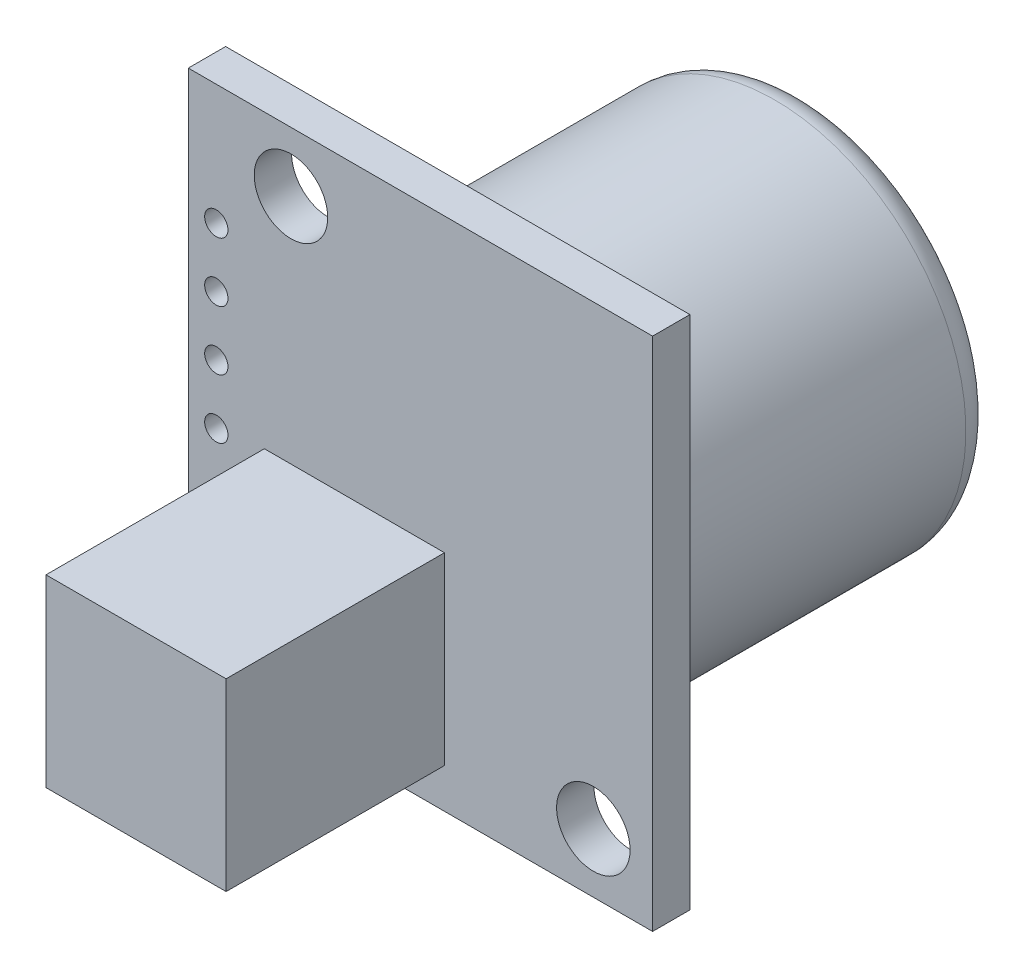
ISO-10303-21;
HEADER;
FILE_DESCRIPTION(('STEP AP214'),'2;1');
FILE_NAME('part.step','',(''),(''),'','','');
FILE_SCHEMA(('AUTOMOTIVE_DESIGN { 1 0 10303 214 1 1 1 1 }'));
ENDSEC;
DATA;
#1=APPLICATION_CONTEXT('core data for automotive mechanical design processes');
#2=APPLICATION_PROTOCOL_DEFINITION('international standard','automotive_design',2000,#1);
#3=PRODUCT_CONTEXT('',#1,'mechanical');
#4=PRODUCT('Part','Part','',(#3));
#5=PRODUCT_RELATED_PRODUCT_CATEGORY('part','',(#4));
#6=PRODUCT_DEFINITION_FORMATION('','',#4);
#7=PRODUCT_DEFINITION_CONTEXT('part definition',#1,'design');
#8=PRODUCT_DEFINITION('design','',#6,#7);
#9=PRODUCT_DEFINITION_SHAPE('','',#8);
#10=(LENGTH_UNIT() NAMED_UNIT(*) SI_UNIT(.MILLI.,.METRE.));
#11=(NAMED_UNIT(*) PLANE_ANGLE_UNIT() SI_UNIT($,.RADIAN.));
#12=(NAMED_UNIT(*) SI_UNIT($,.STERADIAN.) SOLID_ANGLE_UNIT());
#13=UNCERTAINTY_MEASURE_WITH_UNIT(LENGTH_MEASURE(1.E-05),#10,'distance_accuracy_value','');
#14=(GEOMETRIC_REPRESENTATION_CONTEXT(3) GLOBAL_UNCERTAINTY_ASSIGNED_CONTEXT((#13)) GLOBAL_UNIT_ASSIGNED_CONTEXT((#10,
#11,#12)) REPRESENTATION_CONTEXT('',''));
#15=CARTESIAN_POINT('',(0.,0.,0.));
#16=DIRECTION('',(0.,0.,1.));
#17=DIRECTION('',(1.,0.,0.));
#18=AXIS2_PLACEMENT_3D('',#15,#16,#17);
#19=CARTESIAN_POINT('',(0.,0.,1.6));
#20=DIRECTION('',(0.,0.,-1.));
#21=DIRECTION('',(-1.,0.,0.));
#22=AXIS2_PLACEMENT_3D('',#19,#20,#21);
#23=PLANE('',#22);
#24=CARTESIAN_POINT('',(-8.75000000000006,5.88999999999999,1.6));
#25=DIRECTION('',(0.,0.,1.));
#26=DIRECTION('',(1.,0.,0.));
#27=AXIS2_PLACEMENT_3D('',#24,#25,#26);
#28=CIRCLE('',#27,0.500000000000001);
#29=CARTESIAN_POINT('',(-8.25000000000006,5.88999999999999,1.6));
#30=VERTEX_POINT('',#29);
#31=EDGE_CURVE('E130',#30,#30,#28,.T.);
#32=ORIENTED_EDGE('',*,*,#31,.F.);
#33=EDGE_LOOP('',(#32));
#34=FACE_BOUND('',#33,.T.);
#35=CARTESIAN_POINT('',(-8.75000000000004,0.809999999999993,1.6));
#36=DIRECTION('',(0.,0.,1.));
#37=DIRECTION('',(1.,0.,0.));
#38=AXIS2_PLACEMENT_3D('',#35,#36,#37);
#39=CIRCLE('',#38,0.500000000000001);
#40=CARTESIAN_POINT('',(-8.25000000000004,0.809999999999993,1.6));
#41=VERTEX_POINT('',#40);
#42=EDGE_CURVE('E142',#41,#41,#39,.T.);
#43=ORIENTED_EDGE('',*,*,#42,.F.);
#44=EDGE_LOOP('',(#43));
#45=FACE_BOUND('',#44,.T.);
#46=CARTESIAN_POINT('',(-8.75000000000002,-4.27000000000001,1.6));
#47=DIRECTION('',(0.,0.,1.));
#48=DIRECTION('',(1.,0.,0.));
#49=AXIS2_PLACEMENT_3D('',#46,#47,#48);
#50=CIRCLE('',#49,0.500000000000001);
#51=CARTESIAN_POINT('',(-8.25000000000002,-4.27000000000001,1.6));
#52=VERTEX_POINT('',#51);
#53=EDGE_CURVE('E154',#52,#52,#50,.T.);
#54=ORIENTED_EDGE('',*,*,#53,.F.);
#55=EDGE_LOOP('',(#54));
#56=FACE_BOUND('',#55,.T.);
#57=CARTESIAN_POINT('',(-8.75000000000001,-9.35000000000001,1.6));
#58=DIRECTION('',(0.,0.,1.));
#59=DIRECTION('',(1.,0.,0.));
#60=AXIS2_PLACEMENT_3D('',#57,#58,#59);
#61=CIRCLE('',#60,0.500000000000001);
#62=CARTESIAN_POINT('',(-8.25000000000001,-9.35000000000001,1.6));
#63=VERTEX_POINT('',#62);
#64=EDGE_CURVE('E166',#63,#63,#61,.T.);
#65=ORIENTED_EDGE('',*,*,#64,.F.);
#66=EDGE_LOOP('',(#65));
#67=FACE_BOUND('',#66,.T.);
#68=CARTESIAN_POINT('',(-5.55000000000001,8.48999999999999,1.6));
#69=DIRECTION('',(0.,0.,1.));
#70=DIRECTION('',(1.,0.,0.));
#71=AXIS2_PLACEMENT_3D('',#68,#69,#70);
#72=CIRCLE('',#71,1.5748);
#73=CARTESIAN_POINT('',(-3.97520000000001,8.48999999999999,1.6));
#74=VERTEX_POINT('',#73);
#75=EDGE_CURVE('E178',#74,#74,#72,.T.);
#76=ORIENTED_EDGE('',*,*,#75,.F.);
#77=EDGE_LOOP('',(#76));
#78=FACE_BOUND('',#77,.T.);
#79=DIRECTION('',(0.,1.,0.));
#80=VECTOR('',#79,1.);
#81=CARTESIAN_POINT('',(9.94999999999999,-11.05,1.6));
#82=LINE('',#81,#80);
#83=CARTESIAN_POINT('',(9.94999999999999,-11.05,1.6));
#84=VERTEX_POINT('',#83);
#85=CARTESIAN_POINT('',(9.94999999999999,11.05,1.6));
#86=VERTEX_POINT('',#85);
#87=EDGE_CURVE('E184',#84,#86,#82,.T.);
#88=ORIENTED_EDGE('',*,*,#87,.T.);
#89=DIRECTION('',(-1.,0.,0.));
#90=VECTOR('',#89,1.);
#91=CARTESIAN_POINT('',(-9.95000000000001,11.05,1.6));
#92=LINE('',#91,#90);
#93=CARTESIAN_POINT('',(-9.95000000000001,11.05,1.6));
#94=VERTEX_POINT('',#93);
#95=EDGE_CURVE('E187',#86,#94,#92,.T.);
#96=ORIENTED_EDGE('',*,*,#95,.T.);
#97=DIRECTION('',(0.,-1.,0.));
#98=VECTOR('',#97,1.);
#99=CARTESIAN_POINT('',(-9.95000000000001,-11.05,1.6));
#100=LINE('',#99,#98);
#101=CARTESIAN_POINT('',(-9.95000000000001,-11.05,1.6));
#102=VERTEX_POINT('',#101);
#103=EDGE_CURVE('E190',#94,#102,#100,.T.);
#104=ORIENTED_EDGE('',*,*,#103,.T.);
#105=DIRECTION('',(1.,0.,0.));
#106=VECTOR('',#105,1.);
#107=CARTESIAN_POINT('',(-9.95000000000001,-11.05,1.6));
#108=LINE('',#107,#106);
#109=EDGE_CURVE('E192',#102,#84,#108,.T.);
#110=ORIENTED_EDGE('',*,*,#109,.T.);
#111=EDGE_LOOP('',(#88,#96,#104,#110));
#112=FACE_BOUND('',#111,.T.);
#113=CARTESIAN_POINT('',(7.40999999999999,-8.51000000000001,1.6));
#114=DIRECTION('',(0.,0.,1.));
#115=DIRECTION('',(1.,0.,0.));
#116=AXIS2_PLACEMENT_3D('',#113,#114,#115);
#117=CIRCLE('',#116,1.5748);
#118=CARTESIAN_POINT('',(8.98479999999999,-8.51000000000001,1.6));
#119=VERTEX_POINT('',#118);
#120=EDGE_CURVE('E172',#119,#119,#117,.T.);
#121=ORIENTED_EDGE('',*,*,#120,.F.);
#122=EDGE_LOOP('',(#121));
#123=FACE_BOUND('',#122,.T.);
#124=CARTESIAN_POINT('',(-8.75000000000002,-6.81000000000001,1.6));
#125=DIRECTION('',(0.,0.,1.));
#126=DIRECTION('',(1.,0.,0.));
#127=AXIS2_PLACEMENT_3D('',#124,#125,#126);
#128=CIRCLE('',#127,0.500000000000001);
#129=CARTESIAN_POINT('',(-8.25000000000002,-6.81000000000001,1.6));
#130=VERTEX_POINT('',#129);
#131=EDGE_CURVE('E160',#130,#130,#128,.T.);
#132=ORIENTED_EDGE('',*,*,#131,.F.);
#133=EDGE_LOOP('',(#132));
#134=FACE_BOUND('',#133,.T.);
#135=CARTESIAN_POINT('',(-8.75000000000003,-1.73000000000001,1.6));
#136=DIRECTION('',(0.,0.,1.));
#137=DIRECTION('',(1.,0.,0.));
#138=AXIS2_PLACEMENT_3D('',#135,#136,#137);
#139=CIRCLE('',#138,0.500000000000001);
#140=CARTESIAN_POINT('',(-8.25000000000003,-1.73000000000001,1.6));
#141=VERTEX_POINT('',#140);
#142=EDGE_CURVE('E148',#141,#141,#139,.T.);
#143=ORIENTED_EDGE('',*,*,#142,.F.);
#144=EDGE_LOOP('',(#143));
#145=FACE_BOUND('',#144,.T.);
#146=CARTESIAN_POINT('',(-8.75000000000005,3.34999999999999,1.6));
#147=DIRECTION('',(0.,0.,1.));
#148=DIRECTION('',(1.,0.,0.));
#149=AXIS2_PLACEMENT_3D('',#146,#147,#148);
#150=CIRCLE('',#149,0.500000000000001);
#151=CARTESIAN_POINT('',(-8.25000000000005,3.34999999999999,1.6));
#152=VERTEX_POINT('',#151);
#153=EDGE_CURVE('E136',#152,#152,#150,.T.);
#154=ORIENTED_EDGE('',*,*,#153,.F.);
#155=EDGE_LOOP('',(#154));
#156=FACE_BOUND('',#155,.T.);
#157=DIRECTION('',(0.,-1.,0.));
#158=VECTOR('',#157,1.);
#159=CARTESIAN_POINT('',(-6.69,-9.35000000000001,1.6));
#160=LINE('',#159,#158);
#161=CARTESIAN_POINT('',(-6.69,-1.45000000000001,1.6));
#162=VERTEX_POINT('',#161);
#163=CARTESIAN_POINT('',(-6.69,-9.35000000000001,1.6));
#164=VERTEX_POINT('',#163);
#165=EDGE_CURVE('E120',#162,#164,#160,.T.);
#166=ORIENTED_EDGE('',*,*,#165,.F.);
#167=DIRECTION('',(-1.,0.,0.));
#168=VECTOR('',#167,1.);
#169=CARTESIAN_POINT('',(-6.69,-1.45000000000001,1.6));
#170=LINE('',#169,#168);
#171=CARTESIAN_POINT('',(1.02999999999999,-1.45000000000001,1.6));
#172=VERTEX_POINT('',#171);
#173=EDGE_CURVE('E117',#172,#162,#170,.T.);
#174=ORIENTED_EDGE('',*,*,#173,.F.);
#175=DIRECTION('',(0.,1.,0.));
#176=VECTOR('',#175,1.);
#177=CARTESIAN_POINT('',(1.02999999999999,-9.35000000000001,1.6));
#178=LINE('',#177,#176);
#179=CARTESIAN_POINT('',(1.02999999999999,-9.35000000000001,1.6));
#180=VERTEX_POINT('',#179);
#181=EDGE_CURVE('E55',#180,#172,#178,.T.);
#182=ORIENTED_EDGE('',*,*,#181,.F.);
#183=DIRECTION('',(1.,0.,0.));
#184=VECTOR('',#183,1.);
#185=CARTESIAN_POINT('',(-6.69,-9.35000000000001,1.6));
#186=LINE('',#185,#184);
#187=EDGE_CURVE('E50',#164,#180,#186,.T.);
#188=ORIENTED_EDGE('',*,*,#187,.F.);
#189=EDGE_LOOP('',(#166,#174,#182,#188));
#190=FACE_BOUND('',#189,.T.);
#191=ADVANCED_FACE('F35',(#34,#45,#56,#67,#78,#112,#123,#134,#145,#156,#190),#23,.F.);
#192=CARTESIAN_POINT('',(0.,0.,0.));
#193=DIRECTION('',(0.,0.,-1.));
#194=DIRECTION('',(-1.,0.,0.));
#195=AXIS2_PLACEMENT_3D('',#192,#193,#194);
#196=PLANE('',#195);
#197=CARTESIAN_POINT('',(-8.75000000000006,5.88999999999999,0.));
#198=DIRECTION('',(0.,0.,1.));
#199=DIRECTION('',(1.,0.,0.));
#200=AXIS2_PLACEMENT_3D('',#197,#198,#199);
#201=CIRCLE('',#200,0.500000000000001);
#202=CARTESIAN_POINT('',(-8.25000000000006,5.88999999999999,0.));
#203=VERTEX_POINT('',#202);
#204=EDGE_CURVE('E124',#203,#203,#201,.T.);
#205=ORIENTED_EDGE('',*,*,#204,.T.);
#206=EDGE_LOOP('',(#205));
#207=FACE_BOUND('',#206,.T.);
#208=CARTESIAN_POINT('',(-8.75000000000004,0.809999999999993,0.));
#209=DIRECTION('',(0.,0.,1.));
#210=DIRECTION('',(1.,0.,0.));
#211=AXIS2_PLACEMENT_3D('',#208,#209,#210);
#212=CIRCLE('',#211,0.500000000000001);
#213=CARTESIAN_POINT('',(-8.25000000000004,0.809999999999993,0.));
#214=VERTEX_POINT('',#213);
#215=EDGE_CURVE('E139',#214,#214,#212,.T.);
#216=ORIENTED_EDGE('',*,*,#215,.T.);
#217=EDGE_LOOP('',(#216));
#218=FACE_BOUND('',#217,.T.);
#219=CARTESIAN_POINT('',(-8.75000000000002,-4.27000000000001,0.));
#220=DIRECTION('',(0.,0.,1.));
#221=DIRECTION('',(1.,0.,0.));
#222=AXIS2_PLACEMENT_3D('',#219,#220,#221);
#223=CIRCLE('',#222,0.500000000000001);
#224=CARTESIAN_POINT('',(-8.25000000000002,-4.27000000000001,0.));
#225=VERTEX_POINT('',#224);
#226=EDGE_CURVE('E151',#225,#225,#223,.T.);
#227=ORIENTED_EDGE('',*,*,#226,.T.);
#228=EDGE_LOOP('',(#227));
#229=FACE_BOUND('',#228,.T.);
#230=CARTESIAN_POINT('',(-8.75000000000001,-9.35000000000001,0.));
#231=DIRECTION('',(0.,0.,1.));
#232=DIRECTION('',(1.,0.,0.));
#233=AXIS2_PLACEMENT_3D('',#230,#231,#232);
#234=CIRCLE('',#233,0.500000000000001);
#235=CARTESIAN_POINT('',(-8.25000000000001,-9.35000000000001,0.));
#236=VERTEX_POINT('',#235);
#237=EDGE_CURVE('E163',#236,#236,#234,.T.);
#238=ORIENTED_EDGE('',*,*,#237,.T.);
#239=EDGE_LOOP('',(#238));
#240=FACE_BOUND('',#239,.T.);
#241=CARTESIAN_POINT('',(-5.55000000000001,8.48999999999999,0.));
#242=DIRECTION('',(0.,0.,1.));
#243=DIRECTION('',(1.,0.,0.));
#244=AXIS2_PLACEMENT_3D('',#241,#242,#243);
#245=CIRCLE('',#244,1.5748);
#246=CARTESIAN_POINT('',(-3.97520000000001,8.48999999999999,0.));
#247=VERTEX_POINT('',#246);
#248=EDGE_CURVE('E175',#247,#247,#245,.T.);
#249=ORIENTED_EDGE('',*,*,#248,.T.);
#250=EDGE_LOOP('',(#249));
#251=FACE_BOUND('',#250,.T.);
#252=DIRECTION('',(0.,1.,0.));
#253=VECTOR('',#252,1.);
#254=CARTESIAN_POINT('',(9.94999999999999,-11.05,0.));
#255=LINE('',#254,#253);
#256=CARTESIAN_POINT('',(9.94999999999999,-11.05,0.));
#257=VERTEX_POINT('',#256);
#258=CARTESIAN_POINT('',(9.94999999999999,11.05,0.));
#259=VERTEX_POINT('',#258);
#260=EDGE_CURVE('E181',#257,#259,#255,.T.);
#261=ORIENTED_EDGE('',*,*,#260,.F.);
#262=DIRECTION('',(1.,0.,0.));
#263=VECTOR('',#262,1.);
#264=CARTESIAN_POINT('',(-9.95000000000001,-11.05,0.));
#265=LINE('',#264,#263);
#266=CARTESIAN_POINT('',(-9.95000000000001,-11.05,0.));
#267=VERTEX_POINT('',#266);
#268=EDGE_CURVE('E188',#267,#257,#265,.T.);
#269=ORIENTED_EDGE('',*,*,#268,.F.);
#270=DIRECTION('',(0.,-1.,0.));
#271=VECTOR('',#270,1.);
#272=CARTESIAN_POINT('',(-9.95000000000001,-11.05,0.));
#273=LINE('',#272,#271);
#274=CARTESIAN_POINT('',(-9.95000000000001,11.05,0.));
#275=VERTEX_POINT('',#274);
#276=EDGE_CURVE('E199',#275,#267,#273,.T.);
#277=ORIENTED_EDGE('',*,*,#276,.F.);
#278=DIRECTION('',(-1.,0.,0.));
#279=VECTOR('',#278,1.);
#280=CARTESIAN_POINT('',(-9.95000000000001,11.05,0.));
#281=LINE('',#280,#279);
#282=EDGE_CURVE('E197',#259,#275,#281,.T.);
#283=ORIENTED_EDGE('',*,*,#282,.F.);
#284=EDGE_LOOP('',(#261,#269,#277,#283));
#285=FACE_BOUND('',#284,.T.);
#286=CARTESIAN_POINT('',(7.40999999999999,-8.51000000000001,0.));
#287=DIRECTION('',(0.,0.,1.));
#288=DIRECTION('',(1.,0.,0.));
#289=AXIS2_PLACEMENT_3D('',#286,#287,#288);
#290=CIRCLE('',#289,1.5748);
#291=CARTESIAN_POINT('',(8.98479999999999,-8.51000000000001,0.));
#292=VERTEX_POINT('',#291);
#293=EDGE_CURVE('E169',#292,#292,#290,.T.);
#294=ORIENTED_EDGE('',*,*,#293,.T.);
#295=EDGE_LOOP('',(#294));
#296=FACE_BOUND('',#295,.T.);
#297=CARTESIAN_POINT('',(-8.75000000000002,-6.81000000000001,0.));
#298=DIRECTION('',(0.,0.,1.));
#299=DIRECTION('',(1.,0.,0.));
#300=AXIS2_PLACEMENT_3D('',#297,#298,#299);
#301=CIRCLE('',#300,0.500000000000001);
#302=CARTESIAN_POINT('',(-8.25000000000002,-6.81000000000001,0.));
#303=VERTEX_POINT('',#302);
#304=EDGE_CURVE('E157',#303,#303,#301,.T.);
#305=ORIENTED_EDGE('',*,*,#304,.T.);
#306=EDGE_LOOP('',(#305));
#307=FACE_BOUND('',#306,.T.);
#308=CARTESIAN_POINT('',(-8.75000000000003,-1.73000000000001,0.));
#309=DIRECTION('',(0.,0.,1.));
#310=DIRECTION('',(1.,0.,0.));
#311=AXIS2_PLACEMENT_3D('',#308,#309,#310);
#312=CIRCLE('',#311,0.500000000000001);
#313=CARTESIAN_POINT('',(-8.25000000000003,-1.73000000000001,0.));
#314=VERTEX_POINT('',#313);
#315=EDGE_CURVE('E145',#314,#314,#312,.T.);
#316=ORIENTED_EDGE('',*,*,#315,.T.);
#317=EDGE_LOOP('',(#316));
#318=FACE_BOUND('',#317,.T.);
#319=CARTESIAN_POINT('',(-8.75000000000005,3.34999999999999,0.));
#320=DIRECTION('',(0.,0.,1.));
#321=DIRECTION('',(1.,0.,0.));
#322=AXIS2_PLACEMENT_3D('',#319,#320,#321);
#323=CIRCLE('',#322,0.500000000000001);
#324=CARTESIAN_POINT('',(-8.25000000000005,3.34999999999999,0.));
#325=VERTEX_POINT('',#324);
#326=EDGE_CURVE('E133',#325,#325,#323,.T.);
#327=ORIENTED_EDGE('',*,*,#326,.T.);
#328=EDGE_LOOP('',(#327));
#329=FACE_BOUND('',#328,.T.);
#330=CARTESIAN_POINT('',(0.929999999999991,-0.0100000000000071,0.));
#331=DIRECTION('',(0.,0.,-1.));
#332=DIRECTION('',(-1.,0.,0.));
#333=AXIS2_PLACEMENT_3D('',#330,#331,#332);
#334=CIRCLE('',#333,8.2);
#335=CARTESIAN_POINT('',(-7.27000000000001,-0.0100000000000071,0.));
#336=VERTEX_POINT('',#335);
#337=EDGE_CURVE('E121',#336,#336,#334,.T.);
#338=ORIENTED_EDGE('',*,*,#337,.F.);
#339=EDGE_LOOP('',(#338));
#340=FACE_BOUND('',#339,.T.);
#341=ADVANCED_FACE('F229',(#207,#218,#229,#240,#251,#285,#296,#307,#318,#329,#340),#196,.T.);
#342=CARTESIAN_POINT('',(9.94999999999999,-11.05,1.6));
#343=DIRECTION('',(-1.,0.,0.));
#344=DIRECTION('',(0.,0.,1.));
#345=AXIS2_PLACEMENT_3D('',#342,#343,#344);
#346=PLANE('',#345);
#347=ORIENTED_EDGE('',*,*,#260,.T.);
#348=DIRECTION('',(0.,0.,-1.));
#349=VECTOR('',#348,1.);
#350=CARTESIAN_POINT('',(9.94999999999999,11.05,1.6));
#351=LINE('',#350,#349);
#352=EDGE_CURVE('E210',#86,#259,#351,.T.);
#353=ORIENTED_EDGE('',*,*,#352,.F.);
#354=ORIENTED_EDGE('',*,*,#87,.F.);
#355=DIRECTION('',(0.,0.,-1.));
#356=VECTOR('',#355,1.);
#357=CARTESIAN_POINT('',(9.94999999999999,-11.05,1.6));
#358=LINE('',#357,#356);
#359=EDGE_CURVE('E194',#84,#257,#358,.T.);
#360=ORIENTED_EDGE('',*,*,#359,.T.);
#361=EDGE_LOOP('',(#347,#353,#354,#360));
#362=FACE_BOUND('',#361,.T.);
#363=ADVANCED_FACE('F236',(#362),#346,.F.);
#364=CARTESIAN_POINT('',(-9.95000000000001,11.05,1.6));
#365=DIRECTION('',(0.,-1.,0.));
#366=DIRECTION('',(0.,0.,-1.));
#367=AXIS2_PLACEMENT_3D('',#364,#365,#366);
#368=PLANE('',#367);
#369=ORIENTED_EDGE('',*,*,#282,.T.);
#370=DIRECTION('',(0.,0.,-1.));
#371=VECTOR('',#370,1.);
#372=CARTESIAN_POINT('',(-9.95000000000001,11.05,1.6));
#373=LINE('',#372,#371);
#374=EDGE_CURVE('E207',#94,#275,#373,.T.);
#375=ORIENTED_EDGE('',*,*,#374,.F.);
#376=ORIENTED_EDGE('',*,*,#95,.F.);
#377=ORIENTED_EDGE('',*,*,#352,.T.);
#378=EDGE_LOOP('',(#369,#375,#376,#377));
#379=FACE_BOUND('',#378,.T.);
#380=ADVANCED_FACE('F252',(#379),#368,.F.);
#381=CARTESIAN_POINT('',(-9.95000000000001,-11.05,1.6));
#382=DIRECTION('',(1.,0.,0.));
#383=DIRECTION('',(0.,0.,-1.));
#384=AXIS2_PLACEMENT_3D('',#381,#382,#383);
#385=PLANE('',#384);
#386=ORIENTED_EDGE('',*,*,#276,.T.);
#387=DIRECTION('',(0.,0.,-1.));
#388=VECTOR('',#387,1.);
#389=CARTESIAN_POINT('',(-9.95000000000001,-11.05,1.6));
#390=LINE('',#389,#388);
#391=EDGE_CURVE('E204',#102,#267,#390,.T.);
#392=ORIENTED_EDGE('',*,*,#391,.F.);
#393=ORIENTED_EDGE('',*,*,#103,.F.);
#394=ORIENTED_EDGE('',*,*,#374,.T.);
#395=EDGE_LOOP('',(#386,#392,#393,#394));
#396=FACE_BOUND('',#395,.T.);
#397=ADVANCED_FACE('F248',(#396),#385,.F.);
#398=CARTESIAN_POINT('',(-9.95000000000001,-11.05,1.6));
#399=DIRECTION('',(0.,1.,0.));
#400=DIRECTION('',(0.,0.,1.));
#401=AXIS2_PLACEMENT_3D('',#398,#399,#400);
#402=PLANE('',#401);
#403=ORIENTED_EDGE('',*,*,#268,.T.);
#404=ORIENTED_EDGE('',*,*,#359,.F.);
#405=ORIENTED_EDGE('',*,*,#109,.F.);
#406=ORIENTED_EDGE('',*,*,#391,.T.);
#407=EDGE_LOOP('',(#403,#404,#405,#406));
#408=FACE_BOUND('',#407,.T.);
#409=ADVANCED_FACE('F245',(#408),#402,.F.);
#410=CARTESIAN_POINT('',(-5.55000000000001,8.48999999999999,1.6));
#411=DIRECTION('',(0.,0.,-1.));
#412=DIRECTION('',(-1.,0.,0.));
#413=AXIS2_PLACEMENT_3D('',#410,#411,#412);
#414=CYLINDRICAL_SURFACE('',#413,1.5748);
#415=ORIENTED_EDGE('',*,*,#75,.T.);
#416=EDGE_LOOP('',(#415));
#417=FACE_BOUND('',#416,.T.);
#418=ORIENTED_EDGE('',*,*,#248,.F.);
#419=EDGE_LOOP('',(#418));
#420=FACE_BOUND('',#419,.T.);
#421=ADVANCED_FACE('F242',(#417,#420),#414,.F.);
#422=CARTESIAN_POINT('',(7.40999999999999,-8.51000000000001,1.6));
#423=DIRECTION('',(0.,0.,-1.));
#424=DIRECTION('',(-1.,0.,0.));
#425=AXIS2_PLACEMENT_3D('',#422,#423,#424);
#426=CYLINDRICAL_SURFACE('',#425,1.5748);
#427=ORIENTED_EDGE('',*,*,#120,.T.);
#428=EDGE_LOOP('',(#427));
#429=FACE_BOUND('',#428,.T.);
#430=ORIENTED_EDGE('',*,*,#293,.F.);
#431=EDGE_LOOP('',(#430));
#432=FACE_BOUND('',#431,.T.);
#433=ADVANCED_FACE('F335',(#429,#432),#426,.F.);
#434=CARTESIAN_POINT('',(-8.75000000000001,-9.35000000000001,1.6));
#435=DIRECTION('',(0.,0.,-1.));
#436=DIRECTION('',(-1.,0.,0.));
#437=AXIS2_PLACEMENT_3D('',#434,#435,#436);
#438=CYLINDRICAL_SURFACE('',#437,0.500000000000001);
#439=ORIENTED_EDGE('',*,*,#64,.T.);
#440=EDGE_LOOP('',(#439));
#441=FACE_BOUND('',#440,.T.);
#442=ORIENTED_EDGE('',*,*,#237,.F.);
#443=EDGE_LOOP('',(#442));
#444=FACE_BOUND('',#443,.T.);
#445=ADVANCED_FACE('F332',(#441,#444),#438,.F.);
#446=CARTESIAN_POINT('',(-8.75000000000002,-6.81000000000001,1.6));
#447=DIRECTION('',(0.,0.,-1.));
#448=DIRECTION('',(-1.,0.,0.));
#449=AXIS2_PLACEMENT_3D('',#446,#447,#448);
#450=CYLINDRICAL_SURFACE('',#449,0.500000000000001);
#451=ORIENTED_EDGE('',*,*,#131,.T.);
#452=EDGE_LOOP('',(#451));
#453=FACE_BOUND('',#452,.T.);
#454=ORIENTED_EDGE('',*,*,#304,.F.);
#455=EDGE_LOOP('',(#454));
#456=FACE_BOUND('',#455,.T.);
#457=ADVANCED_FACE('F328',(#453,#456),#450,.F.);
#458=CARTESIAN_POINT('',(-8.75000000000002,-4.27000000000001,1.6));
#459=DIRECTION('',(0.,0.,-1.));
#460=DIRECTION('',(-1.,0.,0.));
#461=AXIS2_PLACEMENT_3D('',#458,#459,#460);
#462=CYLINDRICAL_SURFACE('',#461,0.500000000000001);
#463=ORIENTED_EDGE('',*,*,#53,.T.);
#464=EDGE_LOOP('',(#463));
#465=FACE_BOUND('',#464,.T.);
#466=ORIENTED_EDGE('',*,*,#226,.F.);
#467=EDGE_LOOP('',(#466));
#468=FACE_BOUND('',#467,.T.);
#469=ADVANCED_FACE('F324',(#465,#468),#462,.F.);
#470=CARTESIAN_POINT('',(-8.75000000000003,-1.73000000000001,1.6));
#471=DIRECTION('',(0.,0.,-1.));
#472=DIRECTION('',(-1.,0.,0.));
#473=AXIS2_PLACEMENT_3D('',#470,#471,#472);
#474=CYLINDRICAL_SURFACE('',#473,0.500000000000001);
#475=ORIENTED_EDGE('',*,*,#142,.T.);
#476=EDGE_LOOP('',(#475));
#477=FACE_BOUND('',#476,.T.);
#478=ORIENTED_EDGE('',*,*,#315,.F.);
#479=EDGE_LOOP('',(#478));
#480=FACE_BOUND('',#479,.T.);
#481=ADVANCED_FACE('F320',(#477,#480),#474,.F.);
#482=CARTESIAN_POINT('',(-8.75000000000004,0.809999999999993,1.6));
#483=DIRECTION('',(0.,0.,-1.));
#484=DIRECTION('',(-1.,0.,0.));
#485=AXIS2_PLACEMENT_3D('',#482,#483,#484);
#486=CYLINDRICAL_SURFACE('',#485,0.500000000000001);
#487=ORIENTED_EDGE('',*,*,#42,.T.);
#488=EDGE_LOOP('',(#487));
#489=FACE_BOUND('',#488,.T.);
#490=ORIENTED_EDGE('',*,*,#215,.F.);
#491=EDGE_LOOP('',(#490));
#492=FACE_BOUND('',#491,.T.);
#493=ADVANCED_FACE('F316',(#489,#492),#486,.F.);
#494=CARTESIAN_POINT('',(-8.75000000000005,3.34999999999999,1.6));
#495=DIRECTION('',(0.,0.,-1.));
#496=DIRECTION('',(-1.,0.,0.));
#497=AXIS2_PLACEMENT_3D('',#494,#495,#496);
#498=CYLINDRICAL_SURFACE('',#497,0.500000000000001);
#499=ORIENTED_EDGE('',*,*,#153,.T.);
#500=EDGE_LOOP('',(#499));
#501=FACE_BOUND('',#500,.T.);
#502=ORIENTED_EDGE('',*,*,#326,.F.);
#503=EDGE_LOOP('',(#502));
#504=FACE_BOUND('',#503,.T.);
#505=ADVANCED_FACE('F312',(#501,#504),#498,.F.);
#506=CARTESIAN_POINT('',(-8.75000000000006,5.88999999999999,1.6));
#507=DIRECTION('',(0.,0.,-1.));
#508=DIRECTION('',(-1.,0.,0.));
#509=AXIS2_PLACEMENT_3D('',#506,#507,#508);
#510=CYLINDRICAL_SURFACE('',#509,0.500000000000001);
#511=ORIENTED_EDGE('',*,*,#31,.T.);
#512=EDGE_LOOP('',(#511));
#513=FACE_BOUND('',#512,.T.);
#514=ORIENTED_EDGE('',*,*,#204,.F.);
#515=EDGE_LOOP('',(#514));
#516=FACE_BOUND('',#515,.T.);
#517=ADVANCED_FACE('F308',(#513,#516),#510,.F.);
#518=CARTESIAN_POINT('',(0.929999999999991,-0.0100000000000071,-13.9192));
#519=DIRECTION('',(0.,0.,1.));
#520=DIRECTION('',(1.,0.,0.));
#521=AXIS2_PLACEMENT_3D('',#518,#519,#520);
#522=CYLINDRICAL_SURFACE('',#521,8.2);
#523=CARTESIAN_POINT('',(0.929999999999991,-0.0100000000000071,-12.6492));
#524=DIRECTION('',(0.,0.,-1.));
#525=DIRECTION('',(-1.,0.,0.));
#526=AXIS2_PLACEMENT_3D('',#523,#524,#525);
#527=CIRCLE('',#526,8.2);
#528=CARTESIAN_POINT('',(-7.27000000000001,-0.0100000000000071,-12.6492));
#529=VERTEX_POINT('',#528);
#530=EDGE_CURVE('E11',#529,#529,#527,.F.);
#531=ORIENTED_EDGE('',*,*,#530,.T.);
#532=EDGE_LOOP('',(#531));
#533=FACE_BOUND('',#532,.T.);
#534=ORIENTED_EDGE('',*,*,#337,.T.);
#535=EDGE_LOOP('',(#534));
#536=FACE_BOUND('',#535,.T.);
#537=ADVANCED_FACE('F225',(#533,#536),#522,.T.);
#538=CARTESIAN_POINT('',(0.929999999999991,-0.0100000000000071,-13.9192));
#539=DIRECTION('',(0.,0.,-1.));
#540=DIRECTION('',(-1.,0.,0.));
#541=AXIS2_PLACEMENT_3D('',#538,#539,#540);
#542=PLANE('',#541);
#543=CARTESIAN_POINT('',(0.929999999999991,-0.0100000000000071,-13.9192));
#544=DIRECTION('',(0.,0.,-1.));
#545=DIRECTION('',(-1.,0.,0.));
#546=AXIS2_PLACEMENT_3D('',#543,#544,#545);
#547=CIRCLE('',#546,6.93);
#548=CARTESIAN_POINT('',(-6.00000000000001,-0.0100000000000071,-13.9192));
#549=VERTEX_POINT('',#548);
#550=EDGE_CURVE('E43',#549,#549,#547,.T.);
#551=ORIENTED_EDGE('',*,*,#550,.T.);
#552=EDGE_LOOP('',(#551));
#553=FACE_BOUND('',#552,.T.);
#554=ADVANCED_FACE('F215',(#553),#542,.T.);
#555=CARTESIAN_POINT('',(0.929999999999991,-0.0100000000000071,-12.6492));
#556=DIRECTION('',(0.,0.,-1.));
#557=DIRECTION('',(-1.,0.,0.));
#558=AXIS2_PLACEMENT_3D('',#555,#556,#557);
#559=TOROIDAL_SURFACE('',#558,6.93,1.27);
#560=ORIENTED_EDGE('',*,*,#530,.F.);
#561=EDGE_LOOP('',(#560));
#562=FACE_BOUND('',#561,.T.);
#563=ORIENTED_EDGE('',*,*,#550,.F.);
#564=EDGE_LOOP('',(#563));
#565=FACE_BOUND('',#564,.T.);
#566=ADVANCED_FACE('F37',(#562,#565),#559,.T.);
#567=CARTESIAN_POINT('',(-6.69,-9.35000000000001,10.96));
#568=DIRECTION('',(1.,0.,0.));
#569=DIRECTION('',(0.,0.,-1.));
#570=AXIS2_PLACEMENT_3D('',#567,#568,#569);
#571=PLANE('',#570);
#572=ORIENTED_EDGE('',*,*,#165,.T.);
#573=DIRECTION('',(0.,0.,-1.));
#574=VECTOR('',#573,1.);
#575=CARTESIAN_POINT('',(-6.69,-9.35000000000001,10.96));
#576=LINE('',#575,#574);
#577=CARTESIAN_POINT('',(-6.69,-9.35000000000001,10.96));
#578=VERTEX_POINT('',#577);
#579=EDGE_CURVE('E101',#578,#164,#576,.T.);
#580=ORIENTED_EDGE('',*,*,#579,.F.);
#581=DIRECTION('',(0.,-1.,0.));
#582=VECTOR('',#581,1.);
#583=CARTESIAN_POINT('',(-6.69,-9.35000000000001,10.96));
#584=LINE('',#583,#582);
#585=CARTESIAN_POINT('',(-6.69,-1.45000000000001,10.96));
#586=VERTEX_POINT('',#585);
#587=EDGE_CURVE('E108',#586,#578,#584,.T.);
#588=ORIENTED_EDGE('',*,*,#587,.F.);
#589=DIRECTION('',(0.,0.,-1.));
#590=VECTOR('',#589,1.);
#591=CARTESIAN_POINT('',(-6.69,-1.45000000000001,10.96));
#592=LINE('',#591,#590);
#593=EDGE_CURVE('E286',#586,#162,#592,.T.);
#594=ORIENTED_EDGE('',*,*,#593,.T.);
#595=EDGE_LOOP('',(#572,#580,#588,#594));
#596=FACE_BOUND('',#595,.T.);
#597=ADVANCED_FACE('F119',(#596),#571,.F.);
#598=CARTESIAN_POINT('',(-6.69,-9.35000000000001,10.96));
#599=DIRECTION('',(0.,1.,0.));
#600=DIRECTION('',(0.,0.,1.));
#601=AXIS2_PLACEMENT_3D('',#598,#599,#600);
#602=PLANE('',#601);
#603=ORIENTED_EDGE('',*,*,#187,.T.);
#604=DIRECTION('',(0.,0.,-1.));
#605=VECTOR('',#604,1.);
#606=CARTESIAN_POINT('',(1.02999999999999,-9.35000000000001,10.96));
#607=LINE('',#606,#605);
#608=CARTESIAN_POINT('',(1.02999999999999,-9.35000000000001,10.96));
#609=VERTEX_POINT('',#608);
#610=EDGE_CURVE('E104',#609,#180,#607,.T.);
#611=ORIENTED_EDGE('',*,*,#610,.F.);
#612=DIRECTION('',(1.,0.,0.));
#613=VECTOR('',#612,1.);
#614=CARTESIAN_POINT('',(-6.69,-9.35000000000001,10.96));
#615=LINE('',#614,#613);
#616=EDGE_CURVE('E97',#578,#609,#615,.T.);
#617=ORIENTED_EDGE('',*,*,#616,.F.);
#618=ORIENTED_EDGE('',*,*,#579,.T.);
#619=EDGE_LOOP('',(#603,#611,#617,#618));
#620=FACE_BOUND('',#619,.T.);
#621=ADVANCED_FACE('F99',(#620),#602,.F.);
#622=CARTESIAN_POINT('',(1.02999999999999,-9.35000000000001,10.96));
#623=DIRECTION('',(-1.,0.,0.));
#624=DIRECTION('',(0.,0.,1.));
#625=AXIS2_PLACEMENT_3D('',#622,#623,#624);
#626=PLANE('',#625);
#627=ORIENTED_EDGE('',*,*,#181,.T.);
#628=DIRECTION('',(0.,0.,-1.));
#629=VECTOR('',#628,1.);
#630=CARTESIAN_POINT('',(1.02999999999999,-1.45000000000001,10.96));
#631=LINE('',#630,#629);
#632=CARTESIAN_POINT('',(1.02999999999999,-1.45000000000001,10.96));
#633=VERTEX_POINT('',#632);
#634=EDGE_CURVE('E126',#633,#172,#631,.T.);
#635=ORIENTED_EDGE('',*,*,#634,.F.);
#636=DIRECTION('',(0.,1.,0.));
#637=VECTOR('',#636,1.);
#638=CARTESIAN_POINT('',(1.02999999999999,-9.35000000000001,10.96));
#639=LINE('',#638,#637);
#640=EDGE_CURVE('E107',#609,#633,#639,.T.);
#641=ORIENTED_EDGE('',*,*,#640,.F.);
#642=ORIENTED_EDGE('',*,*,#610,.T.);
#643=EDGE_LOOP('',(#627,#635,#641,#642));
#644=FACE_BOUND('',#643,.T.);
#645=ADVANCED_FACE('F295',(#644),#626,.F.);
#646=CARTESIAN_POINT('',(-6.69,-1.45000000000001,10.96));
#647=DIRECTION('',(0.,-1.,0.));
#648=DIRECTION('',(0.,0.,-1.));
#649=AXIS2_PLACEMENT_3D('',#646,#647,#648);
#650=PLANE('',#649);
#651=ORIENTED_EDGE('',*,*,#173,.T.);
#652=ORIENTED_EDGE('',*,*,#593,.F.);
#653=DIRECTION('',(-1.,0.,0.));
#654=VECTOR('',#653,1.);
#655=CARTESIAN_POINT('',(-6.69,-1.45000000000001,10.96));
#656=LINE('',#655,#654);
#657=EDGE_CURVE('E113',#633,#586,#656,.T.);
#658=ORIENTED_EDGE('',*,*,#657,.F.);
#659=ORIENTED_EDGE('',*,*,#634,.T.);
#660=EDGE_LOOP('',(#651,#652,#658,#659));
#661=FACE_BOUND('',#660,.T.);
#662=ADVANCED_FACE('F285',(#661),#650,.F.);
#663=CARTESIAN_POINT('',(0.,0.,10.96));
#664=DIRECTION('',(0.,0.,-1.));
#665=DIRECTION('',(-1.,0.,0.));
#666=AXIS2_PLACEMENT_3D('',#663,#664,#665);
#667=PLANE('',#666);
#668=ORIENTED_EDGE('',*,*,#587,.T.);
#669=ORIENTED_EDGE('',*,*,#616,.T.);
#670=ORIENTED_EDGE('',*,*,#640,.T.);
#671=ORIENTED_EDGE('',*,*,#657,.T.);
#672=EDGE_LOOP('',(#668,#669,#670,#671));
#673=FACE_BOUND('',#672,.T.);
#674=ADVANCED_FACE('F111',(#673),#667,.F.);
#675=CLOSED_SHELL('',(#191,#341,#363,#380,#397,#409,#421,#433,#445,#457,#469,#481,#493,#505,
#517,#537,#554,#566,#597,#621,#645,#662,#674));
#676=MANIFOLD_SOLID_BREP('B2',#675);
#677=ADVANCED_BREP_SHAPE_REPRESENTATION('',(#18,#676),#14);
#678=SHAPE_DEFINITION_REPRESENTATION(#9,#677);
ENDSEC;
END-ISO-10303-21;
